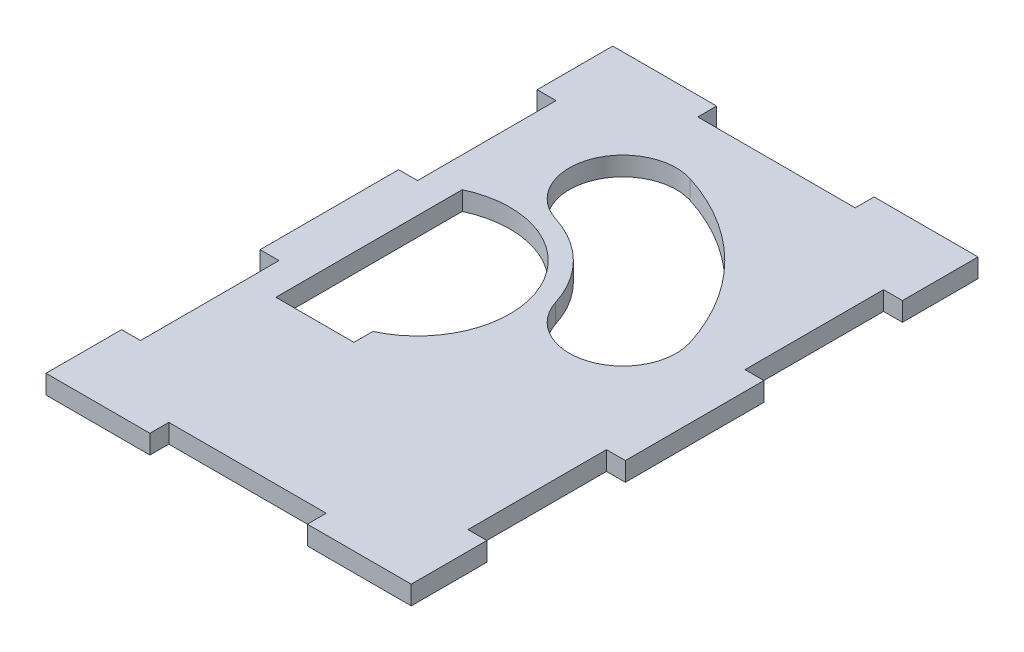
ISO-10303-21;
HEADER;
FILE_DESCRIPTION(('STEP AP214'),'2;1');
FILE_NAME('part.step','',(''),(''),'','','');
FILE_SCHEMA(('AUTOMOTIVE_DESIGN { 1 0 10303 214 1 1 1 1 }'));
ENDSEC;
DATA;
#1=APPLICATION_CONTEXT('core data for automotive mechanical design processes');
#2=APPLICATION_PROTOCOL_DEFINITION('international standard','automotive_design',2000,#1);
#3=PRODUCT_CONTEXT('',#1,'mechanical');
#4=PRODUCT('Part','Part','',(#3));
#5=PRODUCT_RELATED_PRODUCT_CATEGORY('part','',(#4));
#6=PRODUCT_DEFINITION_FORMATION('','',#4);
#7=PRODUCT_DEFINITION_CONTEXT('part definition',#1,'design');
#8=PRODUCT_DEFINITION('design','',#6,#7);
#9=PRODUCT_DEFINITION_SHAPE('','',#8);
#10=(LENGTH_UNIT() NAMED_UNIT(*) SI_UNIT(.MILLI.,.METRE.));
#11=(NAMED_UNIT(*) PLANE_ANGLE_UNIT() SI_UNIT($,.RADIAN.));
#12=(NAMED_UNIT(*) SI_UNIT($,.STERADIAN.) SOLID_ANGLE_UNIT());
#13=UNCERTAINTY_MEASURE_WITH_UNIT(LENGTH_MEASURE(1.E-05),#10,'distance_accuracy_value','');
#14=(GEOMETRIC_REPRESENTATION_CONTEXT(3) GLOBAL_UNCERTAINTY_ASSIGNED_CONTEXT((#13)) GLOBAL_UNIT_ASSIGNED_CONTEXT((#10,
#11,#12)) REPRESENTATION_CONTEXT('',''));
#15=CARTESIAN_POINT('',(0.,0.,0.));
#16=DIRECTION('',(0.,0.,1.));
#17=DIRECTION('',(1.,0.,0.));
#18=AXIS2_PLACEMENT_3D('',#15,#16,#17);
#19=CARTESIAN_POINT('',(0.,3.,0.));
#20=DIRECTION('',(0.,-1.,0.));
#21=DIRECTION('',(0.,0.,-1.));
#22=AXIS2_PLACEMENT_3D('',#19,#20,#21);
#23=PLANE('',#22);
#24=CARTESIAN_POINT('',(12.8024192368406,3.,37.2));
#25=DIRECTION('',(0.,1.,0.));
#26=DIRECTION('',(0.,0.,1.));
#27=AXIS2_PLACEMENT_3D('',#24,#25,#26);
#28=CIRCLE('',#27,8.5);
#29=CARTESIAN_POINT('',(4.69393602479655,3.,39.75));
#30=VERTEX_POINT('',#29);
#31=CARTESIAN_POINT('',(20.9109024488846,3.,34.65));
#32=VERTEX_POINT('',#31);
#33=EDGE_CURVE('E302',#30,#32,#28,.T.);
#34=ORIENTED_EDGE('',*,*,#33,.F.);
#35=CARTESIAN_POINT('',(-12.,3.,45.));
#36=DIRECTION('',(0.,-1.,0.));
#37=DIRECTION('',(0.,0.,1.));
#38=AXIS2_PLACEMENT_3D('',#35,#36,#37);
#39=CIRCLE('',#38,17.5);
#40=CARTESIAN_POINT('',(-6.75,3.,28.3060639752034));
#41=VERTEX_POINT('',#40);
#42=EDGE_CURVE('E310',#41,#30,#39,.T.);
#43=ORIENTED_EDGE('',*,*,#42,.F.);
#44=CARTESIAN_POINT('',(-4.2,3.,20.1975807631594));
#45=DIRECTION('',(0.,1.,0.));
#46=DIRECTION('',(0.,0.,1.));
#47=AXIS2_PLACEMENT_3D('',#44,#45,#46);
#48=CIRCLE('',#47,8.5);
#49=CARTESIAN_POINT('',(-1.65,3.,12.0890975511154));
#50=VERTEX_POINT('',#49);
#51=EDGE_CURVE('E307',#50,#41,#48,.T.);
#52=ORIENTED_EDGE('',*,*,#51,.F.);
#53=CARTESIAN_POINT('',(-12.,3.,45.));
#54=DIRECTION('',(0.,1.,0.));
#55=DIRECTION('',(0.,0.,1.));
#56=AXIS2_PLACEMENT_3D('',#53,#54,#55);
#57=CIRCLE('',#56,34.5);
#58=EDGE_CURVE('E304',#32,#50,#57,.T.);
#59=ORIENTED_EDGE('',*,*,#58,.F.);
#60=EDGE_LOOP('',(#34,#43,#52,#59));
#61=FACE_BOUND('',#60,.T.);
#62=DIRECTION('',(1.,0.,0.));
#63=VECTOR('',#62,1.);
#64=CARTESIAN_POINT('',(-26.,3.,12.));
#65=LINE('',#64,#63);
#66=CARTESIAN_POINT('',(-26.,3.,12.));
#67=VERTEX_POINT('',#66);
#68=CARTESIAN_POINT('',(-23.,3.,12.));
#69=VERTEX_POINT('',#68);
#70=EDGE_CURVE('E333',#67,#69,#65,.T.);
#71=ORIENTED_EDGE('',*,*,#70,.T.);
#72=DIRECTION('',(0.,0.,1.));
#73=VECTOR('',#72,1.);
#74=CARTESIAN_POINT('',(-23.,3.,12.));
#75=LINE('',#74,#73);
#76=CARTESIAN_POINT('',(-23.,3.,34.));
#77=VERTEX_POINT('',#76);
#78=EDGE_CURVE('E336',#69,#77,#75,.T.);
#79=ORIENTED_EDGE('',*,*,#78,.T.);
#80=DIRECTION('',(-1.,0.,0.));
#81=VECTOR('',#80,1.);
#82=CARTESIAN_POINT('',(-23.,3.,34.));
#83=LINE('',#82,#81);
#84=CARTESIAN_POINT('',(-26.,3.,34.));
#85=VERTEX_POINT('',#84);
#86=EDGE_CURVE('E339',#77,#85,#83,.T.);
#87=ORIENTED_EDGE('',*,*,#86,.T.);
#88=DIRECTION('',(0.,0.,1.));
#89=VECTOR('',#88,1.);
#90=CARTESIAN_POINT('',(-26.,3.,34.));
#91=LINE('',#90,#89);
#92=CARTESIAN_POINT('',(-26.,3.,56.));
#93=VERTEX_POINT('',#92);
#94=EDGE_CURVE('E341',#85,#93,#91,.T.);
#95=ORIENTED_EDGE('',*,*,#94,.T.);
#96=DIRECTION('',(1.,0.,0.));
#97=VECTOR('',#96,1.);
#98=CARTESIAN_POINT('',(-26.,3.,56.));
#99=LINE('',#98,#97);
#100=CARTESIAN_POINT('',(-23.,3.,56.));
#101=VERTEX_POINT('',#100);
#102=EDGE_CURVE('E343',#93,#101,#99,.T.);
#103=ORIENTED_EDGE('',*,*,#102,.T.);
#104=DIRECTION('',(0.,0.,1.));
#105=VECTOR('',#104,1.);
#106=CARTESIAN_POINT('',(-23.,3.,56.));
#107=LINE('',#106,#105);
#108=CARTESIAN_POINT('',(-23.,3.,78.));
#109=VERTEX_POINT('',#108);
#110=EDGE_CURVE('E345',#101,#109,#107,.T.);
#111=ORIENTED_EDGE('',*,*,#110,.T.);
#112=DIRECTION('',(-1.,0.,0.));
#113=VECTOR('',#112,1.);
#114=CARTESIAN_POINT('',(-23.,3.,78.));
#115=LINE('',#114,#113);
#116=CARTESIAN_POINT('',(-26.,3.,78.));
#117=VERTEX_POINT('',#116);
#118=EDGE_CURVE('E347',#109,#117,#115,.T.);
#119=ORIENTED_EDGE('',*,*,#118,.T.);
#120=DIRECTION('',(0.,0.,1.));
#121=VECTOR('',#120,1.);
#122=CARTESIAN_POINT('',(-26.,3.,78.));
#123=LINE('',#122,#121);
#124=CARTESIAN_POINT('',(-26.,3.,90.));
#125=VERTEX_POINT('',#124);
#126=EDGE_CURVE('E349',#117,#125,#123,.T.);
#127=ORIENTED_EDGE('',*,*,#126,.T.);
#128=DIRECTION('',(1.,0.,0.));
#129=VECTOR('',#128,1.);
#130=CARTESIAN_POINT('',(-26.,3.,90.));
#131=LINE('',#130,#129);
#132=CARTESIAN_POINT('',(-9.49999999999999,3.,90.));
#133=VERTEX_POINT('',#132);
#134=EDGE_CURVE('E351',#125,#133,#131,.T.);
#135=ORIENTED_EDGE('',*,*,#134,.T.);
#136=DIRECTION('',(0.,0.,-1.));
#137=VECTOR('',#136,1.);
#138=CARTESIAN_POINT('',(-9.49999999999999,3.,90.));
#139=LINE('',#138,#137);
#140=CARTESIAN_POINT('',(-9.5,3.,87.));
#141=VERTEX_POINT('',#140);
#142=EDGE_CURVE('E353',#133,#141,#139,.T.);
#143=ORIENTED_EDGE('',*,*,#142,.T.);
#144=DIRECTION('',(1.,0.,0.));
#145=VECTOR('',#144,1.);
#146=CARTESIAN_POINT('',(-9.5,3.,87.));
#147=LINE('',#146,#145);
#148=CARTESIAN_POINT('',(15.5,3.,87.));
#149=VERTEX_POINT('',#148);
#150=EDGE_CURVE('E355',#141,#149,#147,.T.);
#151=ORIENTED_EDGE('',*,*,#150,.T.);
#152=DIRECTION('',(0.,0.,1.));
#153=VECTOR('',#152,1.);
#154=CARTESIAN_POINT('',(15.5,3.,87.));
#155=LINE('',#154,#153);
#156=CARTESIAN_POINT('',(15.5,3.,90.));
#157=VERTEX_POINT('',#156);
#158=EDGE_CURVE('E357',#149,#157,#155,.T.);
#159=ORIENTED_EDGE('',*,*,#158,.T.);
#160=DIRECTION('',(1.,0.,0.));
#161=VECTOR('',#160,1.);
#162=CARTESIAN_POINT('',(15.5,3.,90.));
#163=LINE('',#162,#161);
#164=CARTESIAN_POINT('',(32.,3.,90.));
#165=VERTEX_POINT('',#164);
#166=EDGE_CURVE('E359',#157,#165,#163,.T.);
#167=ORIENTED_EDGE('',*,*,#166,.T.);
#168=DIRECTION('',(0.,0.,-1.));
#169=VECTOR('',#168,1.);
#170=CARTESIAN_POINT('',(32.,3.,78.));
#171=LINE('',#170,#169);
#172=CARTESIAN_POINT('',(32.,3.,78.));
#173=VERTEX_POINT('',#172);
#174=EDGE_CURVE('E361',#165,#173,#171,.T.);
#175=ORIENTED_EDGE('',*,*,#174,.T.);
#176=DIRECTION('',(-1.,0.,0.));
#177=VECTOR('',#176,1.);
#178=CARTESIAN_POINT('',(32.,3.,78.));
#179=LINE('',#178,#177);
#180=CARTESIAN_POINT('',(29.,3.,78.));
#181=VERTEX_POINT('',#180);
#182=EDGE_CURVE('E363',#173,#181,#179,.T.);
#183=ORIENTED_EDGE('',*,*,#182,.T.);
#184=DIRECTION('',(0.,0.,-1.));
#185=VECTOR('',#184,1.);
#186=CARTESIAN_POINT('',(29.,3.,78.));
#187=LINE('',#186,#185);
#188=CARTESIAN_POINT('',(29.,3.,56.));
#189=VERTEX_POINT('',#188);
#190=EDGE_CURVE('E365',#181,#189,#187,.T.);
#191=ORIENTED_EDGE('',*,*,#190,.T.);
#192=DIRECTION('',(1.,0.,0.));
#193=VECTOR('',#192,1.);
#194=CARTESIAN_POINT('',(29.,3.,56.));
#195=LINE('',#194,#193);
#196=CARTESIAN_POINT('',(32.,3.,56.));
#197=VERTEX_POINT('',#196);
#198=EDGE_CURVE('E367',#189,#197,#195,.T.);
#199=ORIENTED_EDGE('',*,*,#198,.T.);
#200=DIRECTION('',(0.,0.,-1.));
#201=VECTOR('',#200,1.);
#202=CARTESIAN_POINT('',(32.,3.,34.));
#203=LINE('',#202,#201);
#204=CARTESIAN_POINT('',(32.,3.,34.));
#205=VERTEX_POINT('',#204);
#206=EDGE_CURVE('E369',#197,#205,#203,.T.);
#207=ORIENTED_EDGE('',*,*,#206,.T.);
#208=DIRECTION('',(-1.,0.,0.));
#209=VECTOR('',#208,1.);
#210=CARTESIAN_POINT('',(29.,3.,34.));
#211=LINE('',#210,#209);
#212=CARTESIAN_POINT('',(29.,3.,34.));
#213=VERTEX_POINT('',#212);
#214=EDGE_CURVE('E371',#205,#213,#211,.T.);
#215=ORIENTED_EDGE('',*,*,#214,.T.);
#216=DIRECTION('',(0.,0.,-1.));
#217=VECTOR('',#216,1.);
#218=CARTESIAN_POINT('',(29.,3.,12.));
#219=LINE('',#218,#217);
#220=CARTESIAN_POINT('',(29.,3.,12.));
#221=VERTEX_POINT('',#220);
#222=EDGE_CURVE('E373',#213,#221,#219,.T.);
#223=ORIENTED_EDGE('',*,*,#222,.T.);
#224=DIRECTION('',(1.,0.,0.));
#225=VECTOR('',#224,1.);
#226=CARTESIAN_POINT('',(32.,3.,12.));
#227=LINE('',#226,#225);
#228=CARTESIAN_POINT('',(32.,3.,12.));
#229=VERTEX_POINT('',#228);
#230=EDGE_CURVE('E375',#221,#229,#227,.T.);
#231=ORIENTED_EDGE('',*,*,#230,.T.);
#232=DIRECTION('',(0.,0.,-1.));
#233=VECTOR('',#232,1.);
#234=CARTESIAN_POINT('',(32.,3.,0.));
#235=LINE('',#234,#233);
#236=CARTESIAN_POINT('',(32.,3.,0.));
#237=VERTEX_POINT('',#236);
#238=EDGE_CURVE('E377',#229,#237,#235,.T.);
#239=ORIENTED_EDGE('',*,*,#238,.T.);
#240=DIRECTION('',(-1.,0.,0.));
#241=VECTOR('',#240,1.);
#242=CARTESIAN_POINT('',(15.5,3.,0.));
#243=LINE('',#242,#241);
#244=CARTESIAN_POINT('',(15.5,3.,0.));
#245=VERTEX_POINT('',#244);
#246=EDGE_CURVE('E379',#237,#245,#243,.T.);
#247=ORIENTED_EDGE('',*,*,#246,.T.);
#248=DIRECTION('',(0.,0.,1.));
#249=VECTOR('',#248,1.);
#250=CARTESIAN_POINT('',(15.5,3.,3.));
#251=LINE('',#250,#249);
#252=CARTESIAN_POINT('',(15.5,3.,3.));
#253=VERTEX_POINT('',#252);
#254=EDGE_CURVE('E381',#245,#253,#251,.T.);
#255=ORIENTED_EDGE('',*,*,#254,.T.);
#256=DIRECTION('',(-1.,0.,0.));
#257=VECTOR('',#256,1.);
#258=CARTESIAN_POINT('',(-9.5,3.,3.));
#259=LINE('',#258,#257);
#260=CARTESIAN_POINT('',(-9.5,3.,3.));
#261=VERTEX_POINT('',#260);
#262=EDGE_CURVE('E383',#253,#261,#259,.T.);
#263=ORIENTED_EDGE('',*,*,#262,.T.);
#264=DIRECTION('',(0.,0.,-1.));
#265=VECTOR('',#264,1.);
#266=CARTESIAN_POINT('',(-9.5,3.,0.));
#267=LINE('',#266,#265);
#268=CARTESIAN_POINT('',(-9.5,3.,0.));
#269=VERTEX_POINT('',#268);
#270=EDGE_CURVE('E385',#261,#269,#267,.T.);
#271=ORIENTED_EDGE('',*,*,#270,.T.);
#272=DIRECTION('',(-1.,0.,0.));
#273=VECTOR('',#272,1.);
#274=CARTESIAN_POINT('',(-26.,3.,0.));
#275=LINE('',#274,#273);
#276=CARTESIAN_POINT('',(-26.,3.,0.));
#277=VERTEX_POINT('',#276);
#278=EDGE_CURVE('E387',#269,#277,#275,.T.);
#279=ORIENTED_EDGE('',*,*,#278,.T.);
#280=DIRECTION('',(0.,0.,1.));
#281=VECTOR('',#280,1.);
#282=CARTESIAN_POINT('',(-26.,3.,0.));
#283=LINE('',#282,#281);
#284=EDGE_CURVE('E389',#277,#67,#283,.T.);
#285=ORIENTED_EDGE('',*,*,#284,.T.);
#286=EDGE_LOOP('',(#71,#79,#87,#95,#103,#111,#119,#127,#135,#143,#151,#159,#167,#175,#183,#191,
#199,#207,#215,#223,#231,#239,#247,#255,#263,#271,#279,#285));
#287=FACE_BOUND('',#286,.T.);
#288=CARTESIAN_POINT('',(-12.,3.,45.));
#289=DIRECTION('',(0.,1.,0.));
#290=DIRECTION('',(0.,0.,-1.));
#291=AXIS2_PLACEMENT_3D('',#288,#289,#290);
#292=CIRCLE('',#291,14.6741268905513);
#293=CARTESIAN_POINT('',(-5.79999999999999,3.,58.3));
#294=VERTEX_POINT('',#293);
#295=CARTESIAN_POINT('',(-18.2,3.,31.7));
#296=VERTEX_POINT('',#295);
#297=EDGE_CURVE('E266',#294,#296,#292,.T.);
#298=ORIENTED_EDGE('',*,*,#297,.F.);
#299=DIRECTION('',(0.,0.,-1.));
#300=VECTOR('',#299,1.);
#301=CARTESIAN_POINT('',(-5.79999999999999,3.,61.3));
#302=LINE('',#301,#300);
#303=CARTESIAN_POINT('',(-5.79999999999999,3.,61.3));
#304=VERTEX_POINT('',#303);
#305=EDGE_CURVE('E288',#304,#294,#302,.T.);
#306=ORIENTED_EDGE('',*,*,#305,.F.);
#307=DIRECTION('',(1.,0.,0.));
#308=VECTOR('',#307,1.);
#309=CARTESIAN_POINT('',(-18.2,3.,61.3));
#310=LINE('',#309,#308);
#311=CARTESIAN_POINT('',(-18.2,3.,61.3));
#312=VERTEX_POINT('',#311);
#313=EDGE_CURVE('E286',#312,#304,#310,.T.);
#314=ORIENTED_EDGE('',*,*,#313,.F.);
#315=DIRECTION('',(0.,0.,1.));
#316=VECTOR('',#315,1.);
#317=CARTESIAN_POINT('',(-18.2,3.,31.7));
#318=LINE('',#317,#316);
#319=EDGE_CURVE('E274',#296,#312,#318,.T.);
#320=ORIENTED_EDGE('',*,*,#319,.F.);
#321=EDGE_LOOP('',(#298,#306,#314,#320));
#322=FACE_BOUND('',#321,.T.);
#323=ADVANCED_FACE('F33',(#61,#287,#322),#23,.F.);
#324=CARTESIAN_POINT('',(0.,0.,0.));
#325=DIRECTION('',(0.,-1.,0.));
#326=DIRECTION('',(0.,0.,-1.));
#327=AXIS2_PLACEMENT_3D('',#324,#325,#326);
#328=PLANE('',#327);
#329=DIRECTION('',(1.,0.,0.));
#330=VECTOR('',#329,1.);
#331=CARTESIAN_POINT('',(-26.,0.,12.));
#332=LINE('',#331,#330);
#333=CARTESIAN_POINT('',(-26.,0.,12.));
#334=VERTEX_POINT('',#333);
#335=CARTESIAN_POINT('',(-23.,0.,12.));
#336=VERTEX_POINT('',#335);
#337=EDGE_CURVE('E332',#334,#336,#332,.T.);
#338=ORIENTED_EDGE('',*,*,#337,.F.);
#339=DIRECTION('',(0.,0.,1.));
#340=VECTOR('',#339,1.);
#341=CARTESIAN_POINT('',(-26.,0.,0.));
#342=LINE('',#341,#340);
#343=CARTESIAN_POINT('',(-26.,0.,0.));
#344=VERTEX_POINT('',#343);
#345=EDGE_CURVE('E337',#344,#334,#342,.T.);
#346=ORIENTED_EDGE('',*,*,#345,.F.);
#347=DIRECTION('',(-1.,0.,0.));
#348=VECTOR('',#347,1.);
#349=CARTESIAN_POINT('',(-26.,0.,0.));
#350=LINE('',#349,#348);
#351=CARTESIAN_POINT('',(-9.5,0.,0.));
#352=VERTEX_POINT('',#351);
#353=EDGE_CURVE('E444',#352,#344,#350,.T.);
#354=ORIENTED_EDGE('',*,*,#353,.F.);
#355=DIRECTION('',(0.,0.,-1.));
#356=VECTOR('',#355,1.);
#357=CARTESIAN_POINT('',(-9.5,0.,0.));
#358=LINE('',#357,#356);
#359=CARTESIAN_POINT('',(-9.5,0.,3.));
#360=VERTEX_POINT('',#359);
#361=EDGE_CURVE('E442',#360,#352,#358,.T.);
#362=ORIENTED_EDGE('',*,*,#361,.F.);
#363=DIRECTION('',(-1.,0.,0.));
#364=VECTOR('',#363,1.);
#365=CARTESIAN_POINT('',(-9.5,0.,3.));
#366=LINE('',#365,#364);
#367=CARTESIAN_POINT('',(15.5,0.,3.));
#368=VERTEX_POINT('',#367);
#369=EDGE_CURVE('E440',#368,#360,#366,.T.);
#370=ORIENTED_EDGE('',*,*,#369,.F.);
#371=DIRECTION('',(0.,0.,1.));
#372=VECTOR('',#371,1.);
#373=CARTESIAN_POINT('',(15.5,0.,3.));
#374=LINE('',#373,#372);
#375=CARTESIAN_POINT('',(15.5,0.,0.));
#376=VERTEX_POINT('',#375);
#377=EDGE_CURVE('E438',#376,#368,#374,.T.);
#378=ORIENTED_EDGE('',*,*,#377,.F.);
#379=DIRECTION('',(-1.,0.,0.));
#380=VECTOR('',#379,1.);
#381=CARTESIAN_POINT('',(15.5,0.,0.));
#382=LINE('',#381,#380);
#383=CARTESIAN_POINT('',(32.,0.,0.));
#384=VERTEX_POINT('',#383);
#385=EDGE_CURVE('E436',#384,#376,#382,.T.);
#386=ORIENTED_EDGE('',*,*,#385,.F.);
#387=DIRECTION('',(0.,0.,-1.));
#388=VECTOR('',#387,1.);
#389=CARTESIAN_POINT('',(32.,0.,0.));
#390=LINE('',#389,#388);
#391=CARTESIAN_POINT('',(32.,0.,12.));
#392=VERTEX_POINT('',#391);
#393=EDGE_CURVE('E434',#392,#384,#390,.T.);
#394=ORIENTED_EDGE('',*,*,#393,.F.);
#395=DIRECTION('',(1.,0.,0.));
#396=VECTOR('',#395,1.);
#397=CARTESIAN_POINT('',(32.,0.,12.));
#398=LINE('',#397,#396);
#399=CARTESIAN_POINT('',(29.,0.,12.));
#400=VERTEX_POINT('',#399);
#401=EDGE_CURVE('E432',#400,#392,#398,.T.);
#402=ORIENTED_EDGE('',*,*,#401,.F.);
#403=DIRECTION('',(0.,0.,-1.));
#404=VECTOR('',#403,1.);
#405=CARTESIAN_POINT('',(29.,0.,12.));
#406=LINE('',#405,#404);
#407=CARTESIAN_POINT('',(29.,0.,34.));
#408=VERTEX_POINT('',#407);
#409=EDGE_CURVE('E430',#408,#400,#406,.T.);
#410=ORIENTED_EDGE('',*,*,#409,.F.);
#411=DIRECTION('',(-1.,0.,0.));
#412=VECTOR('',#411,1.);
#413=CARTESIAN_POINT('',(29.,0.,34.));
#414=LINE('',#413,#412);
#415=CARTESIAN_POINT('',(32.,0.,34.));
#416=VERTEX_POINT('',#415);
#417=EDGE_CURVE('E428',#416,#408,#414,.T.);
#418=ORIENTED_EDGE('',*,*,#417,.F.);
#419=DIRECTION('',(0.,0.,-1.));
#420=VECTOR('',#419,1.);
#421=CARTESIAN_POINT('',(32.,0.,34.));
#422=LINE('',#421,#420);
#423=CARTESIAN_POINT('',(32.,0.,56.));
#424=VERTEX_POINT('',#423);
#425=EDGE_CURVE('E426',#424,#416,#422,.T.);
#426=ORIENTED_EDGE('',*,*,#425,.F.);
#427=DIRECTION('',(1.,0.,0.));
#428=VECTOR('',#427,1.);
#429=CARTESIAN_POINT('',(29.,0.,56.));
#430=LINE('',#429,#428);
#431=CARTESIAN_POINT('',(29.,0.,56.));
#432=VERTEX_POINT('',#431);
#433=EDGE_CURVE('E424',#432,#424,#430,.T.);
#434=ORIENTED_EDGE('',*,*,#433,.F.);
#435=DIRECTION('',(0.,0.,-1.));
#436=VECTOR('',#435,1.);
#437=CARTESIAN_POINT('',(29.,0.,78.));
#438=LINE('',#437,#436);
#439=CARTESIAN_POINT('',(29.,0.,78.));
#440=VERTEX_POINT('',#439);
#441=EDGE_CURVE('E422',#440,#432,#438,.T.);
#442=ORIENTED_EDGE('',*,*,#441,.F.);
#443=DIRECTION('',(-1.,0.,0.));
#444=VECTOR('',#443,1.);
#445=CARTESIAN_POINT('',(32.,0.,78.));
#446=LINE('',#445,#444);
#447=CARTESIAN_POINT('',(32.,0.,78.));
#448=VERTEX_POINT('',#447);
#449=EDGE_CURVE('E420',#448,#440,#446,.T.);
#450=ORIENTED_EDGE('',*,*,#449,.F.);
#451=DIRECTION('',(0.,0.,-1.));
#452=VECTOR('',#451,1.);
#453=CARTESIAN_POINT('',(32.,0.,78.));
#454=LINE('',#453,#452);
#455=CARTESIAN_POINT('',(32.,0.,90.));
#456=VERTEX_POINT('',#455);
#457=EDGE_CURVE('E418',#456,#448,#454,.T.);
#458=ORIENTED_EDGE('',*,*,#457,.F.);
#459=DIRECTION('',(1.,0.,0.));
#460=VECTOR('',#459,1.);
#461=CARTESIAN_POINT('',(15.5,0.,90.));
#462=LINE('',#461,#460);
#463=CARTESIAN_POINT('',(15.5,0.,90.));
#464=VERTEX_POINT('',#463);
#465=EDGE_CURVE('E416',#464,#456,#462,.T.);
#466=ORIENTED_EDGE('',*,*,#465,.F.);
#467=DIRECTION('',(0.,0.,1.));
#468=VECTOR('',#467,1.);
#469=CARTESIAN_POINT('',(15.5,0.,87.));
#470=LINE('',#469,#468);
#471=CARTESIAN_POINT('',(15.5,0.,87.));
#472=VERTEX_POINT('',#471);
#473=EDGE_CURVE('E414',#472,#464,#470,.T.);
#474=ORIENTED_EDGE('',*,*,#473,.F.);
#475=DIRECTION('',(1.,0.,0.));
#476=VECTOR('',#475,1.);
#477=CARTESIAN_POINT('',(-9.5,0.,87.));
#478=LINE('',#477,#476);
#479=CARTESIAN_POINT('',(-9.5,0.,87.));
#480=VERTEX_POINT('',#479);
#481=EDGE_CURVE('E412',#480,#472,#478,.T.);
#482=ORIENTED_EDGE('',*,*,#481,.F.);
#483=DIRECTION('',(0.,0.,-1.));
#484=VECTOR('',#483,1.);
#485=CARTESIAN_POINT('',(-9.49999999999999,0.,90.));
#486=LINE('',#485,#484);
#487=CARTESIAN_POINT('',(-9.49999999999999,0.,90.));
#488=VERTEX_POINT('',#487);
#489=EDGE_CURVE('E410',#488,#480,#486,.T.);
#490=ORIENTED_EDGE('',*,*,#489,.F.);
#491=DIRECTION('',(1.,0.,0.));
#492=VECTOR('',#491,1.);
#493=CARTESIAN_POINT('',(-26.,0.,90.));
#494=LINE('',#493,#492);
#495=CARTESIAN_POINT('',(-26.,0.,90.));
#496=VERTEX_POINT('',#495);
#497=EDGE_CURVE('E408',#496,#488,#494,.T.);
#498=ORIENTED_EDGE('',*,*,#497,.F.);
#499=DIRECTION('',(0.,0.,1.));
#500=VECTOR('',#499,1.);
#501=CARTESIAN_POINT('',(-26.,0.,78.));
#502=LINE('',#501,#500);
#503=CARTESIAN_POINT('',(-26.,0.,78.));
#504=VERTEX_POINT('',#503);
#505=EDGE_CURVE('E406',#504,#496,#502,.T.);
#506=ORIENTED_EDGE('',*,*,#505,.F.);
#507=DIRECTION('',(-1.,0.,0.));
#508=VECTOR('',#507,1.);
#509=CARTESIAN_POINT('',(-23.,0.,78.));
#510=LINE('',#509,#508);
#511=CARTESIAN_POINT('',(-23.,0.,78.));
#512=VERTEX_POINT('',#511);
#513=EDGE_CURVE('E404',#512,#504,#510,.T.);
#514=ORIENTED_EDGE('',*,*,#513,.F.);
#515=DIRECTION('',(0.,0.,1.));
#516=VECTOR('',#515,1.);
#517=CARTESIAN_POINT('',(-23.,0.,56.));
#518=LINE('',#517,#516);
#519=CARTESIAN_POINT('',(-23.,0.,56.));
#520=VERTEX_POINT('',#519);
#521=EDGE_CURVE('E402',#520,#512,#518,.T.);
#522=ORIENTED_EDGE('',*,*,#521,.F.);
#523=DIRECTION('',(1.,0.,0.));
#524=VECTOR('',#523,1.);
#525=CARTESIAN_POINT('',(-26.,0.,56.));
#526=LINE('',#525,#524);
#527=CARTESIAN_POINT('',(-26.,0.,56.));
#528=VERTEX_POINT('',#527);
#529=EDGE_CURVE('E400',#528,#520,#526,.T.);
#530=ORIENTED_EDGE('',*,*,#529,.F.);
#531=DIRECTION('',(0.,0.,1.));
#532=VECTOR('',#531,1.);
#533=CARTESIAN_POINT('',(-26.,0.,34.));
#534=LINE('',#533,#532);
#535=CARTESIAN_POINT('',(-26.,0.,34.));
#536=VERTEX_POINT('',#535);
#537=EDGE_CURVE('E398',#536,#528,#534,.T.);
#538=ORIENTED_EDGE('',*,*,#537,.F.);
#539=DIRECTION('',(-1.,0.,0.));
#540=VECTOR('',#539,1.);
#541=CARTESIAN_POINT('',(-23.,0.,34.));
#542=LINE('',#541,#540);
#543=CARTESIAN_POINT('',(-23.,0.,34.));
#544=VERTEX_POINT('',#543);
#545=EDGE_CURVE('E396',#544,#536,#542,.T.);
#546=ORIENTED_EDGE('',*,*,#545,.F.);
#547=DIRECTION('',(0.,0.,1.));
#548=VECTOR('',#547,1.);
#549=CARTESIAN_POINT('',(-23.,0.,12.));
#550=LINE('',#549,#548);
#551=EDGE_CURVE('E394',#336,#544,#550,.T.);
#552=ORIENTED_EDGE('',*,*,#551,.F.);
#553=EDGE_LOOP('',(#338,#346,#354,#362,#370,#378,#386,#394,#402,#410,#418,#426,#434,#442,#450,
#458,#466,#474,#482,#490,#498,#506,#514,#522,#530,#538,#546,#552));
#554=FACE_BOUND('',#553,.T.);
#555=CARTESIAN_POINT('',(-12.,0.,45.));
#556=DIRECTION('',(0.,-1.,0.));
#557=DIRECTION('',(0.,0.,1.));
#558=AXIS2_PLACEMENT_3D('',#555,#556,#557);
#559=CIRCLE('',#558,17.5);
#560=CARTESIAN_POINT('',(-6.75,0.,28.3060639752034));
#561=VERTEX_POINT('',#560);
#562=CARTESIAN_POINT('',(4.69393602479655,0.,39.75));
#563=VERTEX_POINT('',#562);
#564=EDGE_CURVE('E305',#561,#563,#559,.T.);
#565=ORIENTED_EDGE('',*,*,#564,.T.);
#566=CARTESIAN_POINT('',(12.8024192368406,0.,37.2));
#567=DIRECTION('',(0.,1.,0.));
#568=DIRECTION('',(0.,0.,1.));
#569=AXIS2_PLACEMENT_3D('',#566,#567,#568);
#570=CIRCLE('',#569,8.5);
#571=CARTESIAN_POINT('',(20.9109024488846,0.,34.65));
#572=VERTEX_POINT('',#571);
#573=EDGE_CURVE('E282',#563,#572,#570,.T.);
#574=ORIENTED_EDGE('',*,*,#573,.T.);
#575=CARTESIAN_POINT('',(-12.,0.,45.));
#576=DIRECTION('',(0.,1.,0.));
#577=DIRECTION('',(0.,0.,1.));
#578=AXIS2_PLACEMENT_3D('',#575,#576,#577);
#579=CIRCLE('',#578,34.5);
#580=CARTESIAN_POINT('',(-1.65,0.,12.0890975511154));
#581=VERTEX_POINT('',#580);
#582=EDGE_CURVE('E315',#572,#581,#579,.T.);
#583=ORIENTED_EDGE('',*,*,#582,.T.);
#584=CARTESIAN_POINT('',(-4.2,0.,20.1975807631594));
#585=DIRECTION('',(0.,1.,0.));
#586=DIRECTION('',(0.,0.,1.));
#587=AXIS2_PLACEMENT_3D('',#584,#585,#586);
#588=CIRCLE('',#587,8.5);
#589=EDGE_CURVE('E318',#581,#561,#588,.T.);
#590=ORIENTED_EDGE('',*,*,#589,.T.);
#591=EDGE_LOOP('',(#565,#574,#583,#590));
#592=FACE_BOUND('',#591,.T.);
#593=DIRECTION('',(0.,0.,-1.));
#594=VECTOR('',#593,1.);
#595=CARTESIAN_POINT('',(-5.79999999999999,0.,61.3));
#596=LINE('',#595,#594);
#597=CARTESIAN_POINT('',(-5.79999999999999,0.,61.3));
#598=VERTEX_POINT('',#597);
#599=CARTESIAN_POINT('',(-5.79999999999999,0.,58.3));
#600=VERTEX_POINT('',#599);
#601=EDGE_CURVE('E275',#598,#600,#596,.T.);
#602=ORIENTED_EDGE('',*,*,#601,.T.);
#603=CARTESIAN_POINT('',(-12.,0.,45.));
#604=DIRECTION('',(0.,1.,0.));
#605=DIRECTION('',(0.,0.,-1.));
#606=AXIS2_PLACEMENT_3D('',#603,#604,#605);
#607=CIRCLE('',#606,14.6741268905513);
#608=CARTESIAN_POINT('',(-18.2,0.,31.7));
#609=VERTEX_POINT('',#608);
#610=EDGE_CURVE('E56',#600,#609,#607,.T.);
#611=ORIENTED_EDGE('',*,*,#610,.T.);
#612=DIRECTION('',(0.,0.,1.));
#613=VECTOR('',#612,1.);
#614=CARTESIAN_POINT('',(-18.2,0.,31.7));
#615=LINE('',#614,#613);
#616=CARTESIAN_POINT('',(-18.2,0.,61.3));
#617=VERTEX_POINT('',#616);
#618=EDGE_CURVE('E281',#609,#617,#615,.T.);
#619=ORIENTED_EDGE('',*,*,#618,.T.);
#620=DIRECTION('',(1.,0.,0.));
#621=VECTOR('',#620,1.);
#622=CARTESIAN_POINT('',(-18.2,0.,61.3));
#623=LINE('',#622,#621);
#624=EDGE_CURVE('E294',#617,#598,#623,.T.);
#625=ORIENTED_EDGE('',*,*,#624,.T.);
#626=EDGE_LOOP('',(#602,#611,#619,#625));
#627=FACE_BOUND('',#626,.T.);
#628=ADVANCED_FACE('F534',(#554,#592,#627),#328,.T.);
#629=CARTESIAN_POINT('',(-26.,3.,12.));
#630=DIRECTION('',(0.,0.,-1.));
#631=DIRECTION('',(-1.,0.,0.));
#632=AXIS2_PLACEMENT_3D('',#629,#630,#631);
#633=PLANE('',#632);
#634=ORIENTED_EDGE('',*,*,#337,.T.);
#635=DIRECTION('',(0.,-1.,0.));
#636=VECTOR('',#635,1.);
#637=CARTESIAN_POINT('',(-23.,3.,12.));
#638=LINE('',#637,#636);
#639=EDGE_CURVE('E11',#69,#336,#638,.T.);
#640=ORIENTED_EDGE('',*,*,#639,.F.);
#641=ORIENTED_EDGE('',*,*,#70,.F.);
#642=DIRECTION('',(0.,-1.,0.));
#643=VECTOR('',#642,1.);
#644=CARTESIAN_POINT('',(-26.,3.,12.));
#645=LINE('',#644,#643);
#646=EDGE_CURVE('E391',#67,#334,#645,.T.);
#647=ORIENTED_EDGE('',*,*,#646,.T.);
#648=EDGE_LOOP('',(#634,#640,#641,#647));
#649=FACE_BOUND('',#648,.T.);
#650=ADVANCED_FACE('F35',(#649),#633,.F.);
#651=CARTESIAN_POINT('',(-23.,3.,12.));
#652=DIRECTION('',(1.,0.,0.));
#653=DIRECTION('',(0.,0.,-1.));
#654=AXIS2_PLACEMENT_3D('',#651,#652,#653);
#655=PLANE('',#654);
#656=ORIENTED_EDGE('',*,*,#551,.T.);
#657=DIRECTION('',(0.,-1.,0.));
#658=VECTOR('',#657,1.);
#659=CARTESIAN_POINT('',(-23.,3.,34.));
#660=LINE('',#659,#658);
#661=EDGE_CURVE('E41',#77,#544,#660,.T.);
#662=ORIENTED_EDGE('',*,*,#661,.F.);
#663=ORIENTED_EDGE('',*,*,#78,.F.);
#664=ORIENTED_EDGE('',*,*,#639,.T.);
#665=EDGE_LOOP('',(#656,#662,#663,#664));
#666=FACE_BOUND('',#665,.T.);
#667=ADVANCED_FACE('F551',(#666),#655,.F.);
#668=CARTESIAN_POINT('',(-23.,3.,34.));
#669=DIRECTION('',(0.,0.,1.));
#670=DIRECTION('',(1.,0.,0.));
#671=AXIS2_PLACEMENT_3D('',#668,#669,#670);
#672=PLANE('',#671);
#673=ORIENTED_EDGE('',*,*,#545,.T.);
#674=DIRECTION('',(0.,-1.,0.));
#675=VECTOR('',#674,1.);
#676=CARTESIAN_POINT('',(-26.,3.,34.));
#677=LINE('',#676,#675);
#678=EDGE_CURVE('E521',#85,#536,#677,.T.);
#679=ORIENTED_EDGE('',*,*,#678,.F.);
#680=ORIENTED_EDGE('',*,*,#86,.F.);
#681=ORIENTED_EDGE('',*,*,#661,.T.);
#682=EDGE_LOOP('',(#673,#679,#680,#681));
#683=FACE_BOUND('',#682,.T.);
#684=ADVANCED_FACE('F528',(#683),#672,.F.);
#685=CARTESIAN_POINT('',(-26.,3.,34.));
#686=DIRECTION('',(1.,0.,0.));
#687=DIRECTION('',(0.,0.,-1.));
#688=AXIS2_PLACEMENT_3D('',#685,#686,#687);
#689=PLANE('',#688);
#690=ORIENTED_EDGE('',*,*,#537,.T.);
#691=DIRECTION('',(0.,-1.,0.));
#692=VECTOR('',#691,1.);
#693=CARTESIAN_POINT('',(-26.,3.,56.));
#694=LINE('',#693,#692);
#695=EDGE_CURVE('E518',#93,#528,#694,.T.);
#696=ORIENTED_EDGE('',*,*,#695,.F.);
#697=ORIENTED_EDGE('',*,*,#94,.F.);
#698=ORIENTED_EDGE('',*,*,#678,.T.);
#699=EDGE_LOOP('',(#690,#696,#697,#698));
#700=FACE_BOUND('',#699,.T.);
#701=ADVANCED_FACE('F540',(#700),#689,.F.);
#702=CARTESIAN_POINT('',(-26.,3.,56.));
#703=DIRECTION('',(0.,0.,-1.));
#704=DIRECTION('',(-1.,0.,0.));
#705=AXIS2_PLACEMENT_3D('',#702,#703,#704);
#706=PLANE('',#705);
#707=ORIENTED_EDGE('',*,*,#529,.T.);
#708=DIRECTION('',(0.,-1.,0.));
#709=VECTOR('',#708,1.);
#710=CARTESIAN_POINT('',(-23.,3.,56.));
#711=LINE('',#710,#709);
#712=EDGE_CURVE('E515',#101,#520,#711,.T.);
#713=ORIENTED_EDGE('',*,*,#712,.F.);
#714=ORIENTED_EDGE('',*,*,#102,.F.);
#715=ORIENTED_EDGE('',*,*,#695,.T.);
#716=EDGE_LOOP('',(#707,#713,#714,#715));
#717=FACE_BOUND('',#716,.T.);
#718=ADVANCED_FACE('F544',(#717),#706,.F.);
#719=CARTESIAN_POINT('',(-23.,3.,56.));
#720=DIRECTION('',(1.,0.,0.));
#721=DIRECTION('',(0.,0.,-1.));
#722=AXIS2_PLACEMENT_3D('',#719,#720,#721);
#723=PLANE('',#722);
#724=ORIENTED_EDGE('',*,*,#521,.T.);
#725=DIRECTION('',(0.,-1.,0.));
#726=VECTOR('',#725,1.);
#727=CARTESIAN_POINT('',(-23.,3.,78.));
#728=LINE('',#727,#726);
#729=EDGE_CURVE('E512',#109,#512,#728,.T.);
#730=ORIENTED_EDGE('',*,*,#729,.F.);
#731=ORIENTED_EDGE('',*,*,#110,.F.);
#732=ORIENTED_EDGE('',*,*,#712,.T.);
#733=EDGE_LOOP('',(#724,#730,#731,#732));
#734=FACE_BOUND('',#733,.T.);
#735=ADVANCED_FACE('F664',(#734),#723,.F.);
#736=CARTESIAN_POINT('',(-23.,3.,78.));
#737=DIRECTION('',(0.,0.,1.));
#738=DIRECTION('',(1.,0.,0.));
#739=AXIS2_PLACEMENT_3D('',#736,#737,#738);
#740=PLANE('',#739);
#741=ORIENTED_EDGE('',*,*,#513,.T.);
#742=DIRECTION('',(0.,-1.,0.));
#743=VECTOR('',#742,1.);
#744=CARTESIAN_POINT('',(-26.,3.,78.));
#745=LINE('',#744,#743);
#746=EDGE_CURVE('E509',#117,#504,#745,.T.);
#747=ORIENTED_EDGE('',*,*,#746,.F.);
#748=ORIENTED_EDGE('',*,*,#118,.F.);
#749=ORIENTED_EDGE('',*,*,#729,.T.);
#750=EDGE_LOOP('',(#741,#747,#748,#749));
#751=FACE_BOUND('',#750,.T.);
#752=ADVANCED_FACE('F661',(#751),#740,.F.);
#753=CARTESIAN_POINT('',(-26.,3.,78.));
#754=DIRECTION('',(1.,0.,0.));
#755=DIRECTION('',(0.,0.,-1.));
#756=AXIS2_PLACEMENT_3D('',#753,#754,#755);
#757=PLANE('',#756);
#758=ORIENTED_EDGE('',*,*,#505,.T.);
#759=DIRECTION('',(0.,-1.,0.));
#760=VECTOR('',#759,1.);
#761=CARTESIAN_POINT('',(-26.,3.,90.));
#762=LINE('',#761,#760);
#763=EDGE_CURVE('E506',#125,#496,#762,.T.);
#764=ORIENTED_EDGE('',*,*,#763,.F.);
#765=ORIENTED_EDGE('',*,*,#126,.F.);
#766=ORIENTED_EDGE('',*,*,#746,.T.);
#767=EDGE_LOOP('',(#758,#764,#765,#766));
#768=FACE_BOUND('',#767,.T.);
#769=ADVANCED_FACE('F657',(#768),#757,.F.);
#770=CARTESIAN_POINT('',(-26.,3.,90.));
#771=DIRECTION('',(0.,0.,-1.));
#772=DIRECTION('',(-1.,0.,0.));
#773=AXIS2_PLACEMENT_3D('',#770,#771,#772);
#774=PLANE('',#773);
#775=ORIENTED_EDGE('',*,*,#497,.T.);
#776=DIRECTION('',(0.,-1.,0.));
#777=VECTOR('',#776,1.);
#778=CARTESIAN_POINT('',(-9.49999999999999,3.,90.));
#779=LINE('',#778,#777);
#780=EDGE_CURVE('E503',#133,#488,#779,.T.);
#781=ORIENTED_EDGE('',*,*,#780,.F.);
#782=ORIENTED_EDGE('',*,*,#134,.F.);
#783=ORIENTED_EDGE('',*,*,#763,.T.);
#784=EDGE_LOOP('',(#775,#781,#782,#783));
#785=FACE_BOUND('',#784,.T.);
#786=ADVANCED_FACE('F653',(#785),#774,.F.);
#787=CARTESIAN_POINT('',(-9.49999999999999,3.,90.));
#788=DIRECTION('',(-1.,0.,0.));
#789=DIRECTION('',(0.,0.,1.));
#790=AXIS2_PLACEMENT_3D('',#787,#788,#789);
#791=PLANE('',#790);
#792=ORIENTED_EDGE('',*,*,#489,.T.);
#793=DIRECTION('',(0.,-1.,0.));
#794=VECTOR('',#793,1.);
#795=CARTESIAN_POINT('',(-9.5,3.,87.));
#796=LINE('',#795,#794);
#797=EDGE_CURVE('E500',#141,#480,#796,.T.);
#798=ORIENTED_EDGE('',*,*,#797,.F.);
#799=ORIENTED_EDGE('',*,*,#142,.F.);
#800=ORIENTED_EDGE('',*,*,#780,.T.);
#801=EDGE_LOOP('',(#792,#798,#799,#800));
#802=FACE_BOUND('',#801,.T.);
#803=ADVANCED_FACE('F648',(#802),#791,.F.);
#804=CARTESIAN_POINT('',(-9.5,3.,87.));
#805=DIRECTION('',(0.,0.,-1.));
#806=DIRECTION('',(-1.,0.,0.));
#807=AXIS2_PLACEMENT_3D('',#804,#805,#806);
#808=PLANE('',#807);
#809=ORIENTED_EDGE('',*,*,#481,.T.);
#810=DIRECTION('',(0.,-1.,0.));
#811=VECTOR('',#810,1.);
#812=CARTESIAN_POINT('',(15.5,3.,87.));
#813=LINE('',#812,#811);
#814=EDGE_CURVE('E497',#149,#472,#813,.T.);
#815=ORIENTED_EDGE('',*,*,#814,.F.);
#816=ORIENTED_EDGE('',*,*,#150,.F.);
#817=ORIENTED_EDGE('',*,*,#797,.T.);
#818=EDGE_LOOP('',(#809,#815,#816,#817));
#819=FACE_BOUND('',#818,.T.);
#820=ADVANCED_FACE('F642',(#819),#808,.F.);
#821=CARTESIAN_POINT('',(15.5,3.,87.));
#822=DIRECTION('',(1.,0.,0.));
#823=DIRECTION('',(0.,0.,-1.));
#824=AXIS2_PLACEMENT_3D('',#821,#822,#823);
#825=PLANE('',#824);
#826=ORIENTED_EDGE('',*,*,#473,.T.);
#827=DIRECTION('',(0.,-1.,0.));
#828=VECTOR('',#827,1.);
#829=CARTESIAN_POINT('',(15.5,3.,90.));
#830=LINE('',#829,#828);
#831=EDGE_CURVE('E494',#157,#464,#830,.T.);
#832=ORIENTED_EDGE('',*,*,#831,.F.);
#833=ORIENTED_EDGE('',*,*,#158,.F.);
#834=ORIENTED_EDGE('',*,*,#814,.T.);
#835=EDGE_LOOP('',(#826,#832,#833,#834));
#836=FACE_BOUND('',#835,.T.);
#837=ADVANCED_FACE('F638',(#836),#825,.F.);
#838=CARTESIAN_POINT('',(15.5,3.,90.));
#839=DIRECTION('',(0.,0.,-1.));
#840=DIRECTION('',(-1.,0.,0.));
#841=AXIS2_PLACEMENT_3D('',#838,#839,#840);
#842=PLANE('',#841);
#843=ORIENTED_EDGE('',*,*,#465,.T.);
#844=DIRECTION('',(0.,-1.,0.));
#845=VECTOR('',#844,1.);
#846=CARTESIAN_POINT('',(32.,3.,90.));
#847=LINE('',#846,#845);
#848=EDGE_CURVE('E491',#165,#456,#847,.T.);
#849=ORIENTED_EDGE('',*,*,#848,.F.);
#850=ORIENTED_EDGE('',*,*,#166,.F.);
#851=ORIENTED_EDGE('',*,*,#831,.T.);
#852=EDGE_LOOP('',(#843,#849,#850,#851));
#853=FACE_BOUND('',#852,.T.);
#854=ADVANCED_FACE('F633',(#853),#842,.F.);
#855=CARTESIAN_POINT('',(32.,3.,78.));
#856=DIRECTION('',(-1.,0.,0.));
#857=DIRECTION('',(0.,0.,1.));
#858=AXIS2_PLACEMENT_3D('',#855,#856,#857);
#859=PLANE('',#858);
#860=ORIENTED_EDGE('',*,*,#457,.T.);
#861=DIRECTION('',(0.,-1.,0.));
#862=VECTOR('',#861,1.);
#863=CARTESIAN_POINT('',(32.,3.,78.));
#864=LINE('',#863,#862);
#865=EDGE_CURVE('E488',#173,#448,#864,.T.);
#866=ORIENTED_EDGE('',*,*,#865,.F.);
#867=ORIENTED_EDGE('',*,*,#174,.F.);
#868=ORIENTED_EDGE('',*,*,#848,.T.);
#869=EDGE_LOOP('',(#860,#866,#867,#868));
#870=FACE_BOUND('',#869,.T.);
#871=ADVANCED_FACE('F627',(#870),#859,.F.);
#872=CARTESIAN_POINT('',(32.,3.,78.));
#873=DIRECTION('',(0.,0.,1.));
#874=DIRECTION('',(1.,0.,0.));
#875=AXIS2_PLACEMENT_3D('',#872,#873,#874);
#876=PLANE('',#875);
#877=ORIENTED_EDGE('',*,*,#449,.T.);
#878=DIRECTION('',(0.,-1.,0.));
#879=VECTOR('',#878,1.);
#880=CARTESIAN_POINT('',(29.,3.,78.));
#881=LINE('',#880,#879);
#882=EDGE_CURVE('E485',#181,#440,#881,.T.);
#883=ORIENTED_EDGE('',*,*,#882,.F.);
#884=ORIENTED_EDGE('',*,*,#182,.F.);
#885=ORIENTED_EDGE('',*,*,#865,.T.);
#886=EDGE_LOOP('',(#877,#883,#884,#885));
#887=FACE_BOUND('',#886,.T.);
#888=ADVANCED_FACE('F623',(#887),#876,.F.);
#889=CARTESIAN_POINT('',(29.,3.,78.));
#890=DIRECTION('',(-1.,0.,0.));
#891=DIRECTION('',(0.,0.,1.));
#892=AXIS2_PLACEMENT_3D('',#889,#890,#891);
#893=PLANE('',#892);
#894=ORIENTED_EDGE('',*,*,#441,.T.);
#895=DIRECTION('',(0.,-1.,0.));
#896=VECTOR('',#895,1.);
#897=CARTESIAN_POINT('',(29.,3.,56.));
#898=LINE('',#897,#896);
#899=EDGE_CURVE('E482',#189,#432,#898,.T.);
#900=ORIENTED_EDGE('',*,*,#899,.F.);
#901=ORIENTED_EDGE('',*,*,#190,.F.);
#902=ORIENTED_EDGE('',*,*,#882,.T.);
#903=EDGE_LOOP('',(#894,#900,#901,#902));
#904=FACE_BOUND('',#903,.T.);
#905=ADVANCED_FACE('F618',(#904),#893,.F.);
#906=CARTESIAN_POINT('',(29.,3.,56.));
#907=DIRECTION('',(0.,0.,-1.));
#908=DIRECTION('',(-1.,0.,0.));
#909=AXIS2_PLACEMENT_3D('',#906,#907,#908);
#910=PLANE('',#909);
#911=ORIENTED_EDGE('',*,*,#433,.T.);
#912=DIRECTION('',(0.,-1.,0.));
#913=VECTOR('',#912,1.);
#914=CARTESIAN_POINT('',(32.,3.,56.));
#915=LINE('',#914,#913);
#916=EDGE_CURVE('E479',#197,#424,#915,.T.);
#917=ORIENTED_EDGE('',*,*,#916,.F.);
#918=ORIENTED_EDGE('',*,*,#198,.F.);
#919=ORIENTED_EDGE('',*,*,#899,.T.);
#920=EDGE_LOOP('',(#911,#917,#918,#919));
#921=FACE_BOUND('',#920,.T.);
#922=ADVANCED_FACE('F612',(#921),#910,.F.);
#923=CARTESIAN_POINT('',(32.,3.,34.));
#924=DIRECTION('',(-1.,0.,0.));
#925=DIRECTION('',(0.,0.,1.));
#926=AXIS2_PLACEMENT_3D('',#923,#924,#925);
#927=PLANE('',#926);
#928=ORIENTED_EDGE('',*,*,#425,.T.);
#929=DIRECTION('',(0.,-1.,0.));
#930=VECTOR('',#929,1.);
#931=CARTESIAN_POINT('',(32.,3.,34.));
#932=LINE('',#931,#930);
#933=EDGE_CURVE('E476',#205,#416,#932,.T.);
#934=ORIENTED_EDGE('',*,*,#933,.F.);
#935=ORIENTED_EDGE('',*,*,#206,.F.);
#936=ORIENTED_EDGE('',*,*,#916,.T.);
#937=EDGE_LOOP('',(#928,#934,#935,#936));
#938=FACE_BOUND('',#937,.T.);
#939=ADVANCED_FACE('F608',(#938),#927,.F.);
#940=CARTESIAN_POINT('',(29.,3.,34.));
#941=DIRECTION('',(0.,0.,1.));
#942=DIRECTION('',(1.,0.,0.));
#943=AXIS2_PLACEMENT_3D('',#940,#941,#942);
#944=PLANE('',#943);
#945=ORIENTED_EDGE('',*,*,#417,.T.);
#946=DIRECTION('',(0.,-1.,0.));
#947=VECTOR('',#946,1.);
#948=CARTESIAN_POINT('',(29.,3.,34.));
#949=LINE('',#948,#947);
#950=EDGE_CURVE('E473',#213,#408,#949,.T.);
#951=ORIENTED_EDGE('',*,*,#950,.F.);
#952=ORIENTED_EDGE('',*,*,#214,.F.);
#953=ORIENTED_EDGE('',*,*,#933,.T.);
#954=EDGE_LOOP('',(#945,#951,#952,#953));
#955=FACE_BOUND('',#954,.T.);
#956=ADVANCED_FACE('F603',(#955),#944,.F.);
#957=CARTESIAN_POINT('',(29.,3.,12.));
#958=DIRECTION('',(-1.,0.,0.));
#959=DIRECTION('',(0.,0.,1.));
#960=AXIS2_PLACEMENT_3D('',#957,#958,#959);
#961=PLANE('',#960);
#962=ORIENTED_EDGE('',*,*,#409,.T.);
#963=DIRECTION('',(0.,-1.,0.));
#964=VECTOR('',#963,1.);
#965=CARTESIAN_POINT('',(29.,3.,12.));
#966=LINE('',#965,#964);
#967=EDGE_CURVE('E470',#221,#400,#966,.T.);
#968=ORIENTED_EDGE('',*,*,#967,.F.);
#969=ORIENTED_EDGE('',*,*,#222,.F.);
#970=ORIENTED_EDGE('',*,*,#950,.T.);
#971=EDGE_LOOP('',(#962,#968,#969,#970));
#972=FACE_BOUND('',#971,.T.);
#973=ADVANCED_FACE('F597',(#972),#961,.F.);
#974=CARTESIAN_POINT('',(32.,3.,12.));
#975=DIRECTION('',(0.,0.,-1.));
#976=DIRECTION('',(-1.,0.,0.));
#977=AXIS2_PLACEMENT_3D('',#974,#975,#976);
#978=PLANE('',#977);
#979=ORIENTED_EDGE('',*,*,#401,.T.);
#980=DIRECTION('',(0.,-1.,0.));
#981=VECTOR('',#980,1.);
#982=CARTESIAN_POINT('',(32.,3.,12.));
#983=LINE('',#982,#981);
#984=EDGE_CURVE('E467',#229,#392,#983,.T.);
#985=ORIENTED_EDGE('',*,*,#984,.F.);
#986=ORIENTED_EDGE('',*,*,#230,.F.);
#987=ORIENTED_EDGE('',*,*,#967,.T.);
#988=EDGE_LOOP('',(#979,#985,#986,#987));
#989=FACE_BOUND('',#988,.T.);
#990=ADVANCED_FACE('F593',(#989),#978,.F.);
#991=CARTESIAN_POINT('',(32.,3.,0.));
#992=DIRECTION('',(-1.,0.,0.));
#993=DIRECTION('',(0.,0.,1.));
#994=AXIS2_PLACEMENT_3D('',#991,#992,#993);
#995=PLANE('',#994);
#996=ORIENTED_EDGE('',*,*,#393,.T.);
#997=DIRECTION('',(0.,-1.,0.));
#998=VECTOR('',#997,1.);
#999=CARTESIAN_POINT('',(32.,3.,0.));
#1000=LINE('',#999,#998);
#1001=EDGE_CURVE('E464',#237,#384,#1000,.T.);
#1002=ORIENTED_EDGE('',*,*,#1001,.F.);
#1003=ORIENTED_EDGE('',*,*,#238,.F.);
#1004=ORIENTED_EDGE('',*,*,#984,.T.);
#1005=EDGE_LOOP('',(#996,#1002,#1003,#1004));
#1006=FACE_BOUND('',#1005,.T.);
#1007=ADVANCED_FACE('F588',(#1006),#995,.F.);
#1008=CARTESIAN_POINT('',(15.5,3.,0.));
#1009=DIRECTION('',(0.,0.,1.));
#1010=DIRECTION('',(1.,0.,0.));
#1011=AXIS2_PLACEMENT_3D('',#1008,#1009,#1010);
#1012=PLANE('',#1011);
#1013=ORIENTED_EDGE('',*,*,#385,.T.);
#1014=DIRECTION('',(0.,-1.,0.));
#1015=VECTOR('',#1014,1.);
#1016=CARTESIAN_POINT('',(15.5,3.,0.));
#1017=LINE('',#1016,#1015);
#1018=EDGE_CURVE('E461',#245,#376,#1017,.T.);
#1019=ORIENTED_EDGE('',*,*,#1018,.F.);
#1020=ORIENTED_EDGE('',*,*,#246,.F.);
#1021=ORIENTED_EDGE('',*,*,#1001,.T.);
#1022=EDGE_LOOP('',(#1013,#1019,#1020,#1021));
#1023=FACE_BOUND('',#1022,.T.);
#1024=ADVANCED_FACE('F582',(#1023),#1012,.F.);
#1025=CARTESIAN_POINT('',(15.5,3.,3.));
#1026=DIRECTION('',(1.,0.,0.));
#1027=DIRECTION('',(0.,0.,-1.));
#1028=AXIS2_PLACEMENT_3D('',#1025,#1026,#1027);
#1029=PLANE('',#1028);
#1030=ORIENTED_EDGE('',*,*,#377,.T.);
#1031=DIRECTION('',(0.,-1.,0.));
#1032=VECTOR('',#1031,1.);
#1033=CARTESIAN_POINT('',(15.5,3.,3.));
#1034=LINE('',#1033,#1032);
#1035=EDGE_CURVE('E458',#253,#368,#1034,.T.);
#1036=ORIENTED_EDGE('',*,*,#1035,.F.);
#1037=ORIENTED_EDGE('',*,*,#254,.F.);
#1038=ORIENTED_EDGE('',*,*,#1018,.T.);
#1039=EDGE_LOOP('',(#1030,#1036,#1037,#1038));
#1040=FACE_BOUND('',#1039,.T.);
#1041=ADVANCED_FACE('F578',(#1040),#1029,.F.);
#1042=CARTESIAN_POINT('',(-9.5,3.,3.));
#1043=DIRECTION('',(0.,0.,1.));
#1044=DIRECTION('',(1.,0.,0.));
#1045=AXIS2_PLACEMENT_3D('',#1042,#1043,#1044);
#1046=PLANE('',#1045);
#1047=ORIENTED_EDGE('',*,*,#369,.T.);
#1048=DIRECTION('',(0.,-1.,0.));
#1049=VECTOR('',#1048,1.);
#1050=CARTESIAN_POINT('',(-9.5,3.,3.));
#1051=LINE('',#1050,#1049);
#1052=EDGE_CURVE('E455',#261,#360,#1051,.T.);
#1053=ORIENTED_EDGE('',*,*,#1052,.F.);
#1054=ORIENTED_EDGE('',*,*,#262,.F.);
#1055=ORIENTED_EDGE('',*,*,#1035,.T.);
#1056=EDGE_LOOP('',(#1047,#1053,#1054,#1055));
#1057=FACE_BOUND('',#1056,.T.);
#1058=ADVANCED_FACE('F573',(#1057),#1046,.F.);
#1059=CARTESIAN_POINT('',(-9.5,3.,0.));
#1060=DIRECTION('',(-1.,0.,0.));
#1061=DIRECTION('',(0.,0.,1.));
#1062=AXIS2_PLACEMENT_3D('',#1059,#1060,#1061);
#1063=PLANE('',#1062);
#1064=ORIENTED_EDGE('',*,*,#361,.T.);
#1065=DIRECTION('',(0.,-1.,0.));
#1066=VECTOR('',#1065,1.);
#1067=CARTESIAN_POINT('',(-9.5,3.,0.));
#1068=LINE('',#1067,#1066);
#1069=EDGE_CURVE('E452',#269,#352,#1068,.T.);
#1070=ORIENTED_EDGE('',*,*,#1069,.F.);
#1071=ORIENTED_EDGE('',*,*,#270,.F.);
#1072=ORIENTED_EDGE('',*,*,#1052,.T.);
#1073=EDGE_LOOP('',(#1064,#1070,#1071,#1072));
#1074=FACE_BOUND('',#1073,.T.);
#1075=ADVANCED_FACE('F567',(#1074),#1063,.F.);
#1076=CARTESIAN_POINT('',(-26.,3.,0.));
#1077=DIRECTION('',(0.,0.,1.));
#1078=DIRECTION('',(1.,0.,0.));
#1079=AXIS2_PLACEMENT_3D('',#1076,#1077,#1078);
#1080=PLANE('',#1079);
#1081=ORIENTED_EDGE('',*,*,#353,.T.);
#1082=DIRECTION('',(0.,-1.,0.));
#1083=VECTOR('',#1082,1.);
#1084=CARTESIAN_POINT('',(-26.,3.,0.));
#1085=LINE('',#1084,#1083);
#1086=EDGE_CURVE('E449',#277,#344,#1085,.T.);
#1087=ORIENTED_EDGE('',*,*,#1086,.F.);
#1088=ORIENTED_EDGE('',*,*,#278,.F.);
#1089=ORIENTED_EDGE('',*,*,#1069,.T.);
#1090=EDGE_LOOP('',(#1081,#1087,#1088,#1089));
#1091=FACE_BOUND('',#1090,.T.);
#1092=ADVANCED_FACE('F563',(#1091),#1080,.F.);
#1093=CARTESIAN_POINT('',(-26.,3.,0.));
#1094=DIRECTION('',(1.,0.,0.));
#1095=DIRECTION('',(0.,0.,-1.));
#1096=AXIS2_PLACEMENT_3D('',#1093,#1094,#1095);
#1097=PLANE('',#1096);
#1098=ORIENTED_EDGE('',*,*,#345,.T.);
#1099=ORIENTED_EDGE('',*,*,#646,.F.);
#1100=ORIENTED_EDGE('',*,*,#284,.F.);
#1101=ORIENTED_EDGE('',*,*,#1086,.T.);
#1102=EDGE_LOOP('',(#1098,#1099,#1100,#1101));
#1103=FACE_BOUND('',#1102,.T.);
#1104=ADVANCED_FACE('F558',(#1103),#1097,.F.);
#1105=CARTESIAN_POINT('',(12.8024192368406,3.,37.2));
#1106=DIRECTION('',(0.,-1.,0.));
#1107=DIRECTION('',(0.,0.,-1.));
#1108=AXIS2_PLACEMENT_3D('',#1105,#1106,#1107);
#1109=CYLINDRICAL_SURFACE('',#1108,8.5);
#1110=ORIENTED_EDGE('',*,*,#573,.F.);
#1111=DIRECTION('',(0.,-1.,0.));
#1112=VECTOR('',#1111,1.);
#1113=CARTESIAN_POINT('',(4.69393602479655,3.,39.75));
#1114=LINE('',#1113,#1112);
#1115=EDGE_CURVE('E312',#30,#563,#1114,.T.);
#1116=ORIENTED_EDGE('',*,*,#1115,.F.);
#1117=ORIENTED_EDGE('',*,*,#33,.T.);
#1118=DIRECTION('',(0.,-1.,0.));
#1119=VECTOR('',#1118,1.);
#1120=CARTESIAN_POINT('',(20.9109024488846,3.,34.65));
#1121=LINE('',#1120,#1119);
#1122=EDGE_CURVE('E329',#32,#572,#1121,.T.);
#1123=ORIENTED_EDGE('',*,*,#1122,.T.);
#1124=EDGE_LOOP('',(#1110,#1116,#1117,#1123));
#1125=FACE_BOUND('',#1124,.T.);
#1126=ADVANCED_FACE('F682',(#1125),#1109,.F.);
#1127=CARTESIAN_POINT('',(-12.,3.,45.));
#1128=DIRECTION('',(0.,-1.,0.));
#1129=DIRECTION('',(0.,0.,-1.));
#1130=AXIS2_PLACEMENT_3D('',#1127,#1128,#1129);
#1131=CYLINDRICAL_SURFACE('',#1130,34.5);
#1132=ORIENTED_EDGE('',*,*,#582,.F.);
#1133=ORIENTED_EDGE('',*,*,#1122,.F.);
#1134=ORIENTED_EDGE('',*,*,#58,.T.);
#1135=DIRECTION('',(0.,-1.,0.));
#1136=VECTOR('',#1135,1.);
#1137=CARTESIAN_POINT('',(-1.65,3.,12.0890975511154));
#1138=LINE('',#1137,#1136);
#1139=EDGE_CURVE('E327',#50,#581,#1138,.T.);
#1140=ORIENTED_EDGE('',*,*,#1139,.T.);
#1141=EDGE_LOOP('',(#1132,#1133,#1134,#1140));
#1142=FACE_BOUND('',#1141,.T.);
#1143=ADVANCED_FACE('F816',(#1142),#1131,.F.);
#1144=CARTESIAN_POINT('',(-4.2,3.,20.1975807631594));
#1145=DIRECTION('',(0.,-1.,0.));
#1146=DIRECTION('',(0.,0.,-1.));
#1147=AXIS2_PLACEMENT_3D('',#1144,#1145,#1146);
#1148=CYLINDRICAL_SURFACE('',#1147,8.5);
#1149=ORIENTED_EDGE('',*,*,#589,.F.);
#1150=ORIENTED_EDGE('',*,*,#1139,.F.);
#1151=ORIENTED_EDGE('',*,*,#51,.T.);
#1152=DIRECTION('',(0.,-1.,0.));
#1153=VECTOR('',#1152,1.);
#1154=CARTESIAN_POINT('',(-6.75,3.,28.3060639752034));
#1155=LINE('',#1154,#1153);
#1156=EDGE_CURVE('E325',#41,#561,#1155,.T.);
#1157=ORIENTED_EDGE('',*,*,#1156,.T.);
#1158=EDGE_LOOP('',(#1149,#1150,#1151,#1157));
#1159=FACE_BOUND('',#1158,.T.);
#1160=ADVANCED_FACE('F823',(#1159),#1148,.F.);
#1161=CARTESIAN_POINT('',(-12.,3.,45.));
#1162=DIRECTION('',(0.,-1.,0.));
#1163=DIRECTION('',(0.,0.,-1.));
#1164=AXIS2_PLACEMENT_3D('',#1161,#1162,#1163);
#1165=CYLINDRICAL_SURFACE('',#1164,17.5);
#1166=ORIENTED_EDGE('',*,*,#564,.F.);
#1167=ORIENTED_EDGE('',*,*,#1156,.F.);
#1168=ORIENTED_EDGE('',*,*,#42,.T.);
#1169=ORIENTED_EDGE('',*,*,#1115,.T.);
#1170=EDGE_LOOP('',(#1166,#1167,#1168,#1169));
#1171=FACE_BOUND('',#1170,.T.);
#1172=ADVANCED_FACE('F830',(#1171),#1165,.T.);
#1173=CARTESIAN_POINT('',(-12.,3.,45.));
#1174=DIRECTION('',(0.,-1.,0.));
#1175=DIRECTION('',(0.,0.,-1.));
#1176=AXIS2_PLACEMENT_3D('',#1173,#1174,#1175);
#1177=CYLINDRICAL_SURFACE('',#1176,14.6741268905513);
#1178=ORIENTED_EDGE('',*,*,#610,.F.);
#1179=DIRECTION('',(0.,-1.,0.));
#1180=VECTOR('',#1179,1.);
#1181=CARTESIAN_POINT('',(-5.79999999999999,3.,58.3));
#1182=LINE('',#1181,#1180);
#1183=EDGE_CURVE('E270',#294,#600,#1182,.T.);
#1184=ORIENTED_EDGE('',*,*,#1183,.F.);
#1185=ORIENTED_EDGE('',*,*,#297,.T.);
#1186=DIRECTION('',(0.,-1.,0.));
#1187=VECTOR('',#1186,1.);
#1188=CARTESIAN_POINT('',(-18.2,3.,31.7));
#1189=LINE('',#1188,#1187);
#1190=EDGE_CURVE('E269',#296,#609,#1189,.T.);
#1191=ORIENTED_EDGE('',*,*,#1190,.T.);
#1192=EDGE_LOOP('',(#1178,#1184,#1185,#1191));
#1193=FACE_BOUND('',#1192,.T.);
#1194=ADVANCED_FACE('F268',(#1193),#1177,.F.);
#1195=CARTESIAN_POINT('',(-18.2,3.,31.7));
#1196=DIRECTION('',(1.,0.,0.));
#1197=DIRECTION('',(0.,0.,-1.));
#1198=AXIS2_PLACEMENT_3D('',#1195,#1196,#1197);
#1199=PLANE('',#1198);
#1200=ORIENTED_EDGE('',*,*,#618,.F.);
#1201=ORIENTED_EDGE('',*,*,#1190,.F.);
#1202=ORIENTED_EDGE('',*,*,#319,.T.);
#1203=DIRECTION('',(0.,-1.,0.));
#1204=VECTOR('',#1203,1.);
#1205=CARTESIAN_POINT('',(-18.2,3.,61.3));
#1206=LINE('',#1205,#1204);
#1207=EDGE_CURVE('E283',#312,#617,#1206,.T.);
#1208=ORIENTED_EDGE('',*,*,#1207,.T.);
#1209=EDGE_LOOP('',(#1200,#1201,#1202,#1208));
#1210=FACE_BOUND('',#1209,.T.);
#1211=ADVANCED_FACE('F278',(#1210),#1199,.T.);
#1212=CARTESIAN_POINT('',(-18.2,3.,61.3));
#1213=DIRECTION('',(0.,0.,-1.));
#1214=DIRECTION('',(-1.,0.,0.));
#1215=AXIS2_PLACEMENT_3D('',#1212,#1213,#1214);
#1216=PLANE('',#1215);
#1217=ORIENTED_EDGE('',*,*,#624,.F.);
#1218=ORIENTED_EDGE('',*,*,#1207,.F.);
#1219=ORIENTED_EDGE('',*,*,#313,.T.);
#1220=DIRECTION('',(0.,-1.,0.));
#1221=VECTOR('',#1220,1.);
#1222=CARTESIAN_POINT('',(-5.79999999999999,3.,61.3));
#1223=LINE('',#1222,#1221);
#1224=EDGE_CURVE('E48',#304,#598,#1223,.T.);
#1225=ORIENTED_EDGE('',*,*,#1224,.T.);
#1226=EDGE_LOOP('',(#1217,#1218,#1219,#1225));
#1227=FACE_BOUND('',#1226,.T.);
#1228=ADVANCED_FACE('F851',(#1227),#1216,.T.);
#1229=CARTESIAN_POINT('',(-5.79999999999999,3.,61.3));
#1230=DIRECTION('',(-1.,0.,0.));
#1231=DIRECTION('',(0.,0.,1.));
#1232=AXIS2_PLACEMENT_3D('',#1229,#1230,#1231);
#1233=PLANE('',#1232);
#1234=ORIENTED_EDGE('',*,*,#601,.F.);
#1235=ORIENTED_EDGE('',*,*,#1224,.F.);
#1236=ORIENTED_EDGE('',*,*,#305,.T.);
#1237=ORIENTED_EDGE('',*,*,#1183,.T.);
#1238=EDGE_LOOP('',(#1234,#1235,#1236,#1237));
#1239=FACE_BOUND('',#1238,.T.);
#1240=ADVANCED_FACE('F858',(#1239),#1233,.T.);
#1241=CLOSED_SHELL('',(#323,#628,#650,#667,#684,#701,#718,#735,#752,#769,#786,#803,#820,#837,
#854,#871,#888,#905,#922,#939,#956,#973,#990,#1007,#1024,#1041,#1058,#1075,#1092,#1104,#1126,
#1143,#1160,#1172,#1194,#1211,#1228,#1240));
#1242=MANIFOLD_SOLID_BREP('B2',#1241);
#1243=ADVANCED_BREP_SHAPE_REPRESENTATION('',(#18,#1242),#14);
#1244=SHAPE_DEFINITION_REPRESENTATION(#9,#1243);
ENDSEC;
END-ISO-10303-21;
